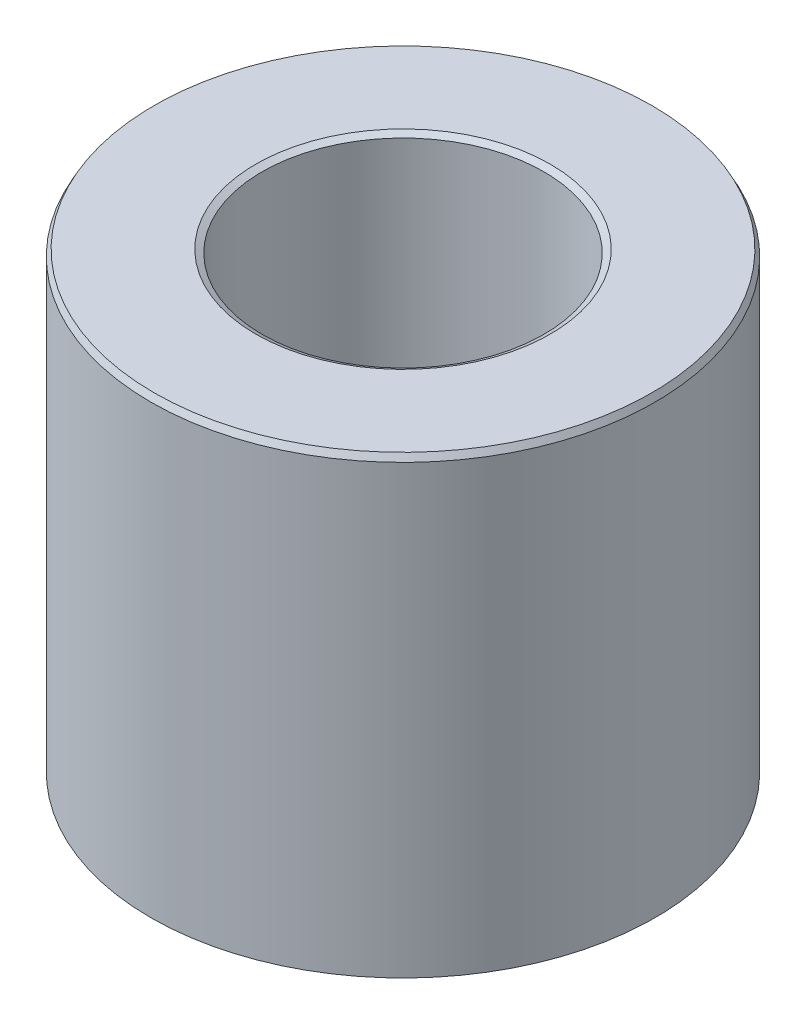
ISO-10303-21;
HEADER;
FILE_DESCRIPTION(('STEP AP214'),'2;1');
FILE_NAME('part.step','',(''),(''),'','','');
FILE_SCHEMA(('AUTOMOTIVE_DESIGN { 1 0 10303 214 1 1 1 1 }'));
ENDSEC;
DATA;
#1=APPLICATION_CONTEXT('core data for automotive mechanical design processes');
#2=APPLICATION_PROTOCOL_DEFINITION('international standard','automotive_design',2000,#1);
#3=PRODUCT_CONTEXT('',#1,'mechanical');
#4=PRODUCT('Part','Part','',(#3));
#5=PRODUCT_RELATED_PRODUCT_CATEGORY('part','',(#4));
#6=PRODUCT_DEFINITION_FORMATION('','',#4);
#7=PRODUCT_DEFINITION_CONTEXT('part definition',#1,'design');
#8=PRODUCT_DEFINITION('design','',#6,#7);
#9=PRODUCT_DEFINITION_SHAPE('','',#8);
#10=(LENGTH_UNIT() NAMED_UNIT(*) SI_UNIT(.MILLI.,.METRE.));
#11=(NAMED_UNIT(*) PLANE_ANGLE_UNIT() SI_UNIT($,.RADIAN.));
#12=(NAMED_UNIT(*) SI_UNIT($,.STERADIAN.) SOLID_ANGLE_UNIT());
#13=UNCERTAINTY_MEASURE_WITH_UNIT(LENGTH_MEASURE(1.E-05),#10,'distance_accuracy_value','');
#14=(GEOMETRIC_REPRESENTATION_CONTEXT(3) GLOBAL_UNCERTAINTY_ASSIGNED_CONTEXT((#13)) GLOBAL_UNIT_ASSIGNED_CONTEXT((#10,
#11,#12)) REPRESENTATION_CONTEXT('',''));
#15=CARTESIAN_POINT('',(0.,0.,0.));
#16=DIRECTION('',(0.,0.,1.));
#17=DIRECTION('',(1.,0.,0.));
#18=AXIS2_PLACEMENT_3D('',#15,#16,#17);
#19=CARTESIAN_POINT('',(0.,45.2233623722908,0.));
#20=DIRECTION('',(0.,-1.,0.));
#21=DIRECTION('',(0.,0.,-1.));
#22=AXIS2_PLACEMENT_3D('',#19,#20,#21);
#23=CYLINDRICAL_SURFACE('',#22,25.);
#24=CARTESIAN_POINT('',(0.,0.334861874186465,0.));
#25=DIRECTION('',(0.,1.,0.));
#26=DIRECTION('',(0.,0.,1.));
#27=AXIS2_PLACEMENT_3D('',#24,#25,#26);
#28=CIRCLE('',#27,25.);
#29=CARTESIAN_POINT('',(0.,0.334861874186465,25.));
#30=VERTEX_POINT('',#29);
#31=EDGE_CURVE('E10',#30,#30,#28,.T.);
#32=ORIENTED_EDGE('',*,*,#31,.T.);
#33=EDGE_LOOP('',(#32));
#34=FACE_BOUND('',#33,.T.);
#35=CARTESIAN_POINT('',(0.,44.593459020928,0.));
#36=DIRECTION('',(0.,1.,0.));
#37=DIRECTION('',(0.,0.,1.));
#38=AXIS2_PLACEMENT_3D('',#35,#36,#37);
#39=CIRCLE('',#38,25.);
#40=CARTESIAN_POINT('',(0.,44.593459020928,25.));
#41=VERTEX_POINT('',#40);
#42=EDGE_CURVE('E50',#41,#41,#39,.F.);
#43=ORIENTED_EDGE('',*,*,#42,.T.);
#44=EDGE_LOOP('',(#43));
#45=FACE_BOUND('',#44,.T.);
#46=ADVANCED_FACE('F39',(#34,#45),#23,.T.);
#47=CARTESIAN_POINT('',(0.,45.2233623722908,0.));
#48=DIRECTION('',(0.,1.,0.));
#49=DIRECTION('',(0.,0.,1.));
#50=AXIS2_PLACEMENT_3D('',#47,#48,#49);
#51=PLANE('',#50);
#52=CARTESIAN_POINT('',(0.,45.2233623722908,0.));
#53=DIRECTION('',(0.,1.,0.));
#54=DIRECTION('',(0.,0.,1.));
#55=AXIS2_PLACEMENT_3D('',#52,#53,#54);
#56=CIRCLE('',#55,14.5956025923475);
#57=CARTESIAN_POINT('',(0.,45.2233623722908,14.5956025923475));
#58=VERTEX_POINT('',#57);
#59=EDGE_CURVE('E58',#58,#58,#56,.F.);
#60=ORIENTED_EDGE('',*,*,#59,.T.);
#61=EDGE_LOOP('',(#60));
#62=FACE_BOUND('',#61,.T.);
#63=CARTESIAN_POINT('',(0.,45.2233623722908,0.));
#64=DIRECTION('',(0.,1.,0.));
#65=DIRECTION('',(0.,0.,1.));
#66=AXIS2_PLACEMENT_3D('',#63,#64,#65);
#67=CIRCLE('',#66,24.6651381258135);
#68=CARTESIAN_POINT('',(0.,45.2233623722908,24.6651381258135));
#69=VERTEX_POINT('',#68);
#70=EDGE_CURVE('E61',#69,#69,#67,.T.);
#71=ORIENTED_EDGE('',*,*,#70,.T.);
#72=EDGE_LOOP('',(#71));
#73=FACE_BOUND('',#72,.T.);
#74=ADVANCED_FACE('F88',(#62,#73),#51,.T.);
#75=CARTESIAN_POINT('',(0.,0.,0.));
#76=DIRECTION('',(0.,1.,0.));
#77=DIRECTION('',(0.,0.,1.));
#78=AXIS2_PLACEMENT_3D('',#75,#76,#77);
#79=PLANE('',#78);
#80=CARTESIAN_POINT('',(0.,0.,0.));
#81=DIRECTION('',(0.,1.,0.));
#82=DIRECTION('',(0.,0.,1.));
#83=AXIS2_PLACEMENT_3D('',#80,#81,#82);
#84=CIRCLE('',#83,14.3005611151711);
#85=CARTESIAN_POINT('',(0.,0.,14.3005611151711));
#86=VERTEX_POINT('',#85);
#87=EDGE_CURVE('E51',#86,#86,#84,.T.);
#88=ORIENTED_EDGE('',*,*,#87,.T.);
#89=EDGE_LOOP('',(#88));
#90=FACE_BOUND('',#89,.T.);
#91=CARTESIAN_POINT('',(0.,0.,0.));
#92=DIRECTION('',(0.,1.,0.));
#93=DIRECTION('',(0.,0.,1.));
#94=AXIS2_PLACEMENT_3D('',#91,#92,#93);
#95=CIRCLE('',#94,24.3700966486372);
#96=CARTESIAN_POINT('',(0.,0.,24.3700966486372));
#97=VERTEX_POINT('',#96);
#98=EDGE_CURVE('E54',#97,#97,#95,.F.);
#99=ORIENTED_EDGE('',*,*,#98,.T.);
#100=EDGE_LOOP('',(#99));
#101=FACE_BOUND('',#100,.T.);
#102=ADVANCED_FACE('F83',(#90,#101),#79,.F.);
#103=CARTESIAN_POINT('',(0.,45.2233623722908,0.));
#104=DIRECTION('',(0.,-1.,0.));
#105=DIRECTION('',(0.,0.,-1.));
#106=AXIS2_PLACEMENT_3D('',#103,#104,#105);
#107=CYLINDRICAL_SURFACE('',#106,13.9656992409847);
#108=CARTESIAN_POINT('',(0.,44.8885004981043,0.));
#109=DIRECTION('',(0.,1.,0.));
#110=DIRECTION('',(0.,0.,1.));
#111=AXIS2_PLACEMENT_3D('',#108,#109,#110);
#112=CIRCLE('',#111,13.9656992409847);
#113=CARTESIAN_POINT('',(0.,44.8885004981043,13.9656992409847));
#114=VERTEX_POINT('',#113);
#115=EDGE_CURVE('E67',#114,#114,#112,.T.);
#116=ORIENTED_EDGE('',*,*,#115,.T.);
#117=EDGE_LOOP('',(#116));
#118=FACE_BOUND('',#117,.T.);
#119=CARTESIAN_POINT('',(0.,0.629903351362766,0.));
#120=DIRECTION('',(0.,1.,0.));
#121=DIRECTION('',(0.,0.,1.));
#122=AXIS2_PLACEMENT_3D('',#119,#120,#121);
#123=CIRCLE('',#122,13.9656992409847);
#124=CARTESIAN_POINT('',(0.,0.629903351362766,13.9656992409847));
#125=VERTEX_POINT('',#124);
#126=EDGE_CURVE('E69',#125,#125,#123,.F.);
#127=ORIENTED_EDGE('',*,*,#126,.T.);
#128=EDGE_LOOP('',(#127));
#129=FACE_BOUND('',#128,.T.);
#130=ADVANCED_FACE('F71',(#118,#129),#107,.F.);
#131=CARTESIAN_POINT('',(0.,44.8885004981043,0.));
#132=DIRECTION('',(0.,1.,0.));
#133=DIRECTION('',(0.,0.,1.));
#134=AXIS2_PLACEMENT_3D('',#131,#132,#133);
#135=CONICAL_SURFACE('',#134,13.9656992409847,1.08218295121977);
#136=ORIENTED_EDGE('',*,*,#59,.F.);
#137=EDGE_LOOP('',(#136));
#138=FACE_BOUND('',#137,.T.);
#139=ORIENTED_EDGE('',*,*,#115,.F.);
#140=EDGE_LOOP('',(#139));
#141=FACE_BOUND('',#140,.T.);
#142=ADVANCED_FACE('F77',(#138,#141),#135,.F.);
#143=CARTESIAN_POINT('',(0.,0.,0.));
#144=DIRECTION('',(0.,-1.,0.));
#145=DIRECTION('',(0.,0.,-1.));
#146=AXIS2_PLACEMENT_3D('',#143,#144,#145);
#147=CONICAL_SURFACE('',#146,14.3005611151711,0.488613375575121);
#148=ORIENTED_EDGE('',*,*,#126,.F.);
#149=EDGE_LOOP('',(#148));
#150=FACE_BOUND('',#149,.T.);
#151=ORIENTED_EDGE('',*,*,#87,.F.);
#152=EDGE_LOOP('',(#151));
#153=FACE_BOUND('',#152,.T.);
#154=ADVANCED_FACE('F73',(#150,#153),#147,.F.);
#155=CARTESIAN_POINT('',(0.,0.334861874186465,0.));
#156=DIRECTION('',(0.,1.,0.));
#157=DIRECTION('',(0.,0.,1.));
#158=AXIS2_PLACEMENT_3D('',#155,#156,#157);
#159=CONICAL_SURFACE('',#158,25.,1.08218295121977);
#160=ORIENTED_EDGE('',*,*,#98,.F.);
#161=EDGE_LOOP('',(#160));
#162=FACE_BOUND('',#161,.T.);
#163=ORIENTED_EDGE('',*,*,#31,.F.);
#164=EDGE_LOOP('',(#163));
#165=FACE_BOUND('',#164,.T.);
#166=ADVANCED_FACE('F76',(#162,#165),#159,.T.);
#167=CARTESIAN_POINT('',(0.,45.2233623722908,0.));
#168=DIRECTION('',(0.,-1.,0.));
#169=DIRECTION('',(0.,0.,-1.));
#170=AXIS2_PLACEMENT_3D('',#167,#168,#169);
#171=CONICAL_SURFACE('',#170,24.6651381258135,0.488613375575112);
#172=ORIENTED_EDGE('',*,*,#42,.F.);
#173=EDGE_LOOP('',(#172));
#174=FACE_BOUND('',#173,.T.);
#175=ORIENTED_EDGE('',*,*,#70,.F.);
#176=EDGE_LOOP('',(#175));
#177=FACE_BOUND('',#176,.T.);
#178=ADVANCED_FACE('F45',(#174,#177),#171,.T.);
#179=CLOSED_SHELL('',(#46,#74,#102,#130,#142,#154,#166,#178));
#180=MANIFOLD_SOLID_BREP('B2',#179);
#181=ADVANCED_BREP_SHAPE_REPRESENTATION('',(#18,#180),#14);
#182=SHAPE_DEFINITION_REPRESENTATION(#9,#181);
ENDSEC;
END-ISO-10303-21;
